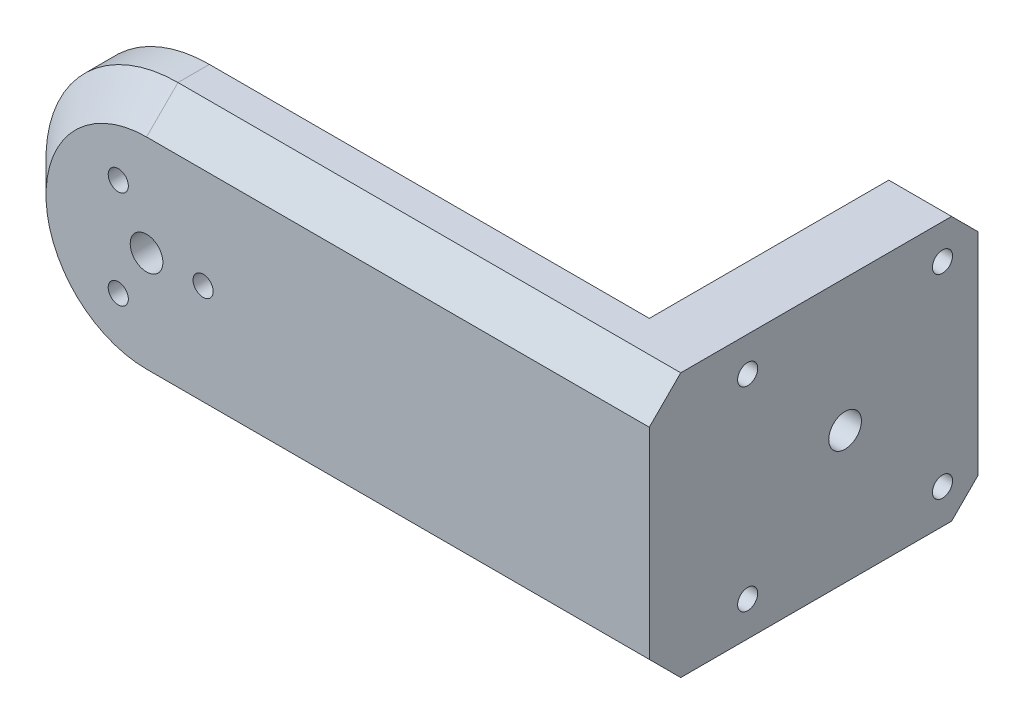
ISO-10303-21;
HEADER;
FILE_DESCRIPTION(('STEP AP214'),'2;1');
FILE_NAME('part.step','',(''),(''),'','','');
FILE_SCHEMA(('AUTOMOTIVE_DESIGN { 1 0 10303 214 1 1 1 1 }'));
ENDSEC;
DATA;
#1=APPLICATION_CONTEXT('core data for automotive mechanical design processes');
#2=APPLICATION_PROTOCOL_DEFINITION('international standard','automotive_design',2000,#1);
#3=PRODUCT_CONTEXT('',#1,'mechanical');
#4=PRODUCT('Part','Part','',(#3));
#5=PRODUCT_RELATED_PRODUCT_CATEGORY('part','',(#4));
#6=PRODUCT_DEFINITION_FORMATION('','',#4);
#7=PRODUCT_DEFINITION_CONTEXT('part definition',#1,'design');
#8=PRODUCT_DEFINITION('design','',#6,#7);
#9=PRODUCT_DEFINITION_SHAPE('','',#8);
#10=(LENGTH_UNIT() NAMED_UNIT(*) SI_UNIT(.MILLI.,.METRE.));
#11=(NAMED_UNIT(*) PLANE_ANGLE_UNIT() SI_UNIT($,.RADIAN.));
#12=(NAMED_UNIT(*) SI_UNIT($,.STERADIAN.) SOLID_ANGLE_UNIT());
#13=UNCERTAINTY_MEASURE_WITH_UNIT(LENGTH_MEASURE(1.E-05),#10,'distance_accuracy_value','');
#14=(GEOMETRIC_REPRESENTATION_CONTEXT(3) GLOBAL_UNCERTAINTY_ASSIGNED_CONTEXT((#13)) GLOBAL_UNIT_ASSIGNED_CONTEXT((#10,
#11,#12)) REPRESENTATION_CONTEXT('',''));
#15=CARTESIAN_POINT('',(0.,0.,0.));
#16=DIRECTION('',(0.,0.,1.));
#17=DIRECTION('',(1.,0.,0.));
#18=AXIS2_PLACEMENT_3D('',#15,#16,#17);
#19=CARTESIAN_POINT('',(80.,0.,-20.15));
#20=DIRECTION('',(-1.,0.,0.));
#21=DIRECTION('',(0.,0.,1.));
#22=AXIS2_PLACEMENT_3D('',#19,#20,#21);
#23=CYLINDRICAL_SURFACE('',#22,2.6);
#24=CARTESIAN_POINT('',(80.,0.,-20.15));
#25=DIRECTION('',(-1.,0.,0.));
#26=DIRECTION('',(0.,0.,1.));
#27=AXIS2_PLACEMENT_3D('',#24,#25,#26);
#28=CIRCLE('',#27,2.6);
#29=CARTESIAN_POINT('',(80.,0.,-17.55));
#30=VERTEX_POINT('',#29);
#31=EDGE_CURVE('E263',#30,#30,#28,.T.);
#32=ORIENTED_EDGE('',*,*,#31,.F.);
#33=EDGE_LOOP('',(#32));
#34=FACE_BOUND('',#33,.T.);
#35=CARTESIAN_POINT('',(73.,0.,-20.15));
#36=DIRECTION('',(-1.,0.,0.));
#37=DIRECTION('',(0.,0.,1.));
#38=AXIS2_PLACEMENT_3D('',#35,#36,#37);
#39=CIRCLE('',#38,2.6);
#40=CARTESIAN_POINT('',(73.,0.,-17.55));
#41=VERTEX_POINT('',#40);
#42=EDGE_CURVE('E183',#41,#41,#39,.F.);
#43=ORIENTED_EDGE('',*,*,#42,.F.);
#44=EDGE_LOOP('',(#43));
#45=FACE_BOUND('',#44,.T.);
#46=ADVANCED_FACE('F39',(#34,#45),#23,.F.);
#47=CARTESIAN_POINT('',(0.,0.,11.));
#48=DIRECTION('',(0.,0.,-1.));
#49=DIRECTION('',(-1.,0.,0.));
#50=AXIS2_PLACEMENT_3D('',#47,#48,#49);
#51=CYLINDRICAL_SURFACE('',#50,12.5);
#52=CARTESIAN_POINT('',(0.,0.,0.));
#53=DIRECTION('',(0.,0.,1.));
#54=DIRECTION('',(1.,0.,0.));
#55=AXIS2_PLACEMENT_3D('',#52,#53,#54);
#56=CIRCLE('',#55,12.5);
#57=CARTESIAN_POINT('',(12.5,0.,0.));
#58=VERTEX_POINT('',#57);
#59=EDGE_CURVE('E170',#58,#58,#56,.T.);
#60=ORIENTED_EDGE('',*,*,#59,.T.);
#61=EDGE_LOOP('',(#60));
#62=FACE_BOUND('',#61,.T.);
#63=CARTESIAN_POINT('',(0.,0.,0.999999999999999));
#64=DIRECTION('',(0.,0.,1.));
#65=DIRECTION('',(1.,0.,0.));
#66=AXIS2_PLACEMENT_3D('',#63,#64,#65);
#67=CIRCLE('',#66,12.5);
#68=CARTESIAN_POINT('',(12.5,0.,0.999999999999999));
#69=VERTEX_POINT('',#68);
#70=EDGE_CURVE('E175',#69,#69,#67,.T.);
#71=ORIENTED_EDGE('',*,*,#70,.F.);
#72=EDGE_LOOP('',(#71));
#73=FACE_BOUND('',#72,.T.);
#74=ADVANCED_FACE('F329',(#62,#73),#51,.T.);
#75=CARTESIAN_POINT('',(0.,0.,11.));
#76=DIRECTION('',(0.,0.,1.));
#77=DIRECTION('',(1.,0.,0.));
#78=AXIS2_PLACEMENT_3D('',#75,#76,#77);
#79=PLANE('',#78);
#80=DIRECTION('',(0.,-1.,0.));
#81=VECTOR('',#80,1.);
#82=CARTESIAN_POINT('',(80.,21.,11.));
#83=LINE('',#82,#81);
#84=CARTESIAN_POINT('',(80.,16.,11.));
#85=VERTEX_POINT('',#84);
#86=CARTESIAN_POINT('',(80.,-16.,11.));
#87=VERTEX_POINT('',#86);
#88=EDGE_CURVE('E128',#85,#87,#83,.T.);
#89=ORIENTED_EDGE('',*,*,#88,.F.);
#90=DIRECTION('',(-1.,0.,0.));
#91=VECTOR('',#90,1.);
#92=CARTESIAN_POINT('',(0.,16.,11.));
#93=LINE('',#92,#91);
#94=CARTESIAN_POINT('',(0.,16.,11.));
#95=VERTEX_POINT('',#94);
#96=EDGE_CURVE('E191',#85,#95,#93,.T.);
#97=ORIENTED_EDGE('',*,*,#96,.T.);
#98=CARTESIAN_POINT('',(0.,0.,11.));
#99=DIRECTION('',(0.,0.,1.));
#100=DIRECTION('',(1.,0.,0.));
#101=AXIS2_PLACEMENT_3D('',#98,#99,#100);
#102=CIRCLE('',#101,16.);
#103=CARTESIAN_POINT('',(0.,-16.,11.));
#104=VERTEX_POINT('',#103);
#105=EDGE_CURVE('E178',#95,#104,#102,.T.);
#106=ORIENTED_EDGE('',*,*,#105,.T.);
#107=DIRECTION('',(1.,0.,0.));
#108=VECTOR('',#107,1.);
#109=CARTESIAN_POINT('',(0.,-16.,11.));
#110=LINE('',#109,#108);
#111=EDGE_CURVE('E189',#104,#87,#110,.T.);
#112=ORIENTED_EDGE('',*,*,#111,.T.);
#113=EDGE_LOOP('',(#89,#97,#106,#112));
#114=FACE_BOUND('',#113,.T.);
#115=CARTESIAN_POINT('',(0.,0.,11.));
#116=DIRECTION('',(0.,0.,-1.));
#117=DIRECTION('',(-1.,0.,0.));
#118=AXIS2_PLACEMENT_3D('',#115,#116,#117);
#119=CIRCLE('',#118,2.6);
#120=CARTESIAN_POINT('',(-2.6,0.,11.));
#121=VERTEX_POINT('',#120);
#122=EDGE_CURVE('E182',#121,#121,#119,.T.);
#123=ORIENTED_EDGE('',*,*,#122,.T.);
#124=EDGE_LOOP('',(#123));
#125=FACE_BOUND('',#124,.T.);
#126=CARTESIAN_POINT('',(-4.50000000000004,-7.79422863405992,11.));
#127=DIRECTION('',(0.,0.,1.));
#128=DIRECTION('',(1.,0.,0.));
#129=AXIS2_PLACEMENT_3D('',#126,#127,#128);
#130=CIRCLE('',#129,1.6);
#131=CARTESIAN_POINT('',(-2.90000000000004,-7.79422863405992,11.));
#132=VERTEX_POINT('',#131);
#133=EDGE_CURVE('E161',#132,#132,#130,.T.);
#134=ORIENTED_EDGE('',*,*,#133,.F.);
#135=EDGE_LOOP('',(#134));
#136=FACE_BOUND('',#135,.T.);
#137=CARTESIAN_POINT('',(9.,0.,11.));
#138=DIRECTION('',(0.,0.,1.));
#139=DIRECTION('',(1.,0.,0.));
#140=AXIS2_PLACEMENT_3D('',#137,#138,#139);
#141=CIRCLE('',#140,1.6);
#142=CARTESIAN_POINT('',(10.6,0.,11.));
#143=VERTEX_POINT('',#142);
#144=EDGE_CURVE('E167',#143,#143,#141,.T.);
#145=ORIENTED_EDGE('',*,*,#144,.F.);
#146=EDGE_LOOP('',(#145));
#147=FACE_BOUND('',#146,.T.);
#148=CARTESIAN_POINT('',(-4.49999999999992,7.79422863405999,11.));
#149=DIRECTION('',(0.,0.,1.));
#150=DIRECTION('',(1.,0.,0.));
#151=AXIS2_PLACEMENT_3D('',#148,#149,#150);
#152=CIRCLE('',#151,1.6);
#153=CARTESIAN_POINT('',(-2.89999999999992,7.79422863405999,11.));
#154=VERTEX_POINT('',#153);
#155=EDGE_CURVE('E155',#154,#154,#152,.T.);
#156=ORIENTED_EDGE('',*,*,#155,.F.);
#157=EDGE_LOOP('',(#156));
#158=FACE_BOUND('',#157,.T.);
#159=ADVANCED_FACE('F250',(#114,#125,#136,#147,#158),#79,.T.);
#160=CARTESIAN_POINT('',(0.,0.,0.));
#161=DIRECTION('',(0.,0.,1.));
#162=DIRECTION('',(1.,0.,0.));
#163=AXIS2_PLACEMENT_3D('',#160,#161,#162);
#164=PLANE('',#163);
#165=CARTESIAN_POINT('',(0.,0.,0.));
#166=DIRECTION('',(0.,0.,1.));
#167=DIRECTION('',(1.,0.,0.));
#168=AXIS2_PLACEMENT_3D('',#165,#166,#167);
#169=CIRCLE('',#168,2.6);
#170=CARTESIAN_POINT('',(2.6,0.,0.));
#171=VERTEX_POINT('',#170);
#172=EDGE_CURVE('E179',#171,#171,#169,.T.);
#173=ORIENTED_EDGE('',*,*,#172,.T.);
#174=EDGE_LOOP('',(#173));
#175=FACE_BOUND('',#174,.T.);
#176=ORIENTED_EDGE('',*,*,#59,.F.);
#177=EDGE_LOOP('',(#176));
#178=FACE_BOUND('',#177,.T.);
#179=CARTESIAN_POINT('',(9.,0.,0.));
#180=DIRECTION('',(0.,0.,1.));
#181=DIRECTION('',(1.,0.,0.));
#182=AXIS2_PLACEMENT_3D('',#179,#180,#181);
#183=CIRCLE('',#182,1.6);
#184=CARTESIAN_POINT('',(10.6,0.,0.));
#185=VERTEX_POINT('',#184);
#186=EDGE_CURVE('E164',#185,#185,#183,.T.);
#187=ORIENTED_EDGE('',*,*,#186,.T.);
#188=EDGE_LOOP('',(#187));
#189=FACE_BOUND('',#188,.T.);
#190=CARTESIAN_POINT('',(-4.50000000000004,-7.79422863405992,0.));
#191=DIRECTION('',(0.,0.,1.));
#192=DIRECTION('',(1.,0.,0.));
#193=AXIS2_PLACEMENT_3D('',#190,#191,#192);
#194=CIRCLE('',#193,1.6);
#195=CARTESIAN_POINT('',(-2.90000000000004,-7.79422863405992,0.));
#196=VERTEX_POINT('',#195);
#197=EDGE_CURVE('E158',#196,#196,#194,.T.);
#198=ORIENTED_EDGE('',*,*,#197,.T.);
#199=EDGE_LOOP('',(#198));
#200=FACE_BOUND('',#199,.T.);
#201=CARTESIAN_POINT('',(-4.49999999999992,7.79422863405999,0.));
#202=DIRECTION('',(0.,0.,1.));
#203=DIRECTION('',(1.,0.,0.));
#204=AXIS2_PLACEMENT_3D('',#201,#202,#203);
#205=CIRCLE('',#204,1.6);
#206=CARTESIAN_POINT('',(-2.89999999999992,7.79422863405999,0.));
#207=VERTEX_POINT('',#206);
#208=EDGE_CURVE('E152',#207,#207,#205,.T.);
#209=ORIENTED_EDGE('',*,*,#208,.T.);
#210=EDGE_LOOP('',(#209));
#211=FACE_BOUND('',#210,.T.);
#212=ADVANCED_FACE('F391',(#175,#178,#189,#200,#211),#164,.F.);
#213=CARTESIAN_POINT('',(9.,0.,11.));
#214=DIRECTION('',(0.,0.,-1.));
#215=DIRECTION('',(-1.,0.,0.));
#216=AXIS2_PLACEMENT_3D('',#213,#214,#215);
#217=CYLINDRICAL_SURFACE('',#216,1.6);
#218=ORIENTED_EDGE('',*,*,#144,.T.);
#219=EDGE_LOOP('',(#218));
#220=FACE_BOUND('',#219,.T.);
#221=ORIENTED_EDGE('',*,*,#186,.F.);
#222=EDGE_LOOP('',(#221));
#223=FACE_BOUND('',#222,.T.);
#224=ADVANCED_FACE('F387',(#220,#223),#217,.F.);
#225=CARTESIAN_POINT('',(-4.50000000000004,-7.79422863405992,11.));
#226=DIRECTION('',(0.,0.,-1.));
#227=DIRECTION('',(-1.,0.,0.));
#228=AXIS2_PLACEMENT_3D('',#225,#226,#227);
#229=CYLINDRICAL_SURFACE('',#228,1.6);
#230=ORIENTED_EDGE('',*,*,#133,.T.);
#231=EDGE_LOOP('',(#230));
#232=FACE_BOUND('',#231,.T.);
#233=ORIENTED_EDGE('',*,*,#197,.F.);
#234=EDGE_LOOP('',(#233));
#235=FACE_BOUND('',#234,.T.);
#236=ADVANCED_FACE('F383',(#232,#235),#229,.F.);
#237=CARTESIAN_POINT('',(-4.49999999999992,7.79422863405999,11.));
#238=DIRECTION('',(0.,0.,-1.));
#239=DIRECTION('',(-1.,0.,0.));
#240=AXIS2_PLACEMENT_3D('',#237,#238,#239);
#241=CYLINDRICAL_SURFACE('',#240,1.6);
#242=ORIENTED_EDGE('',*,*,#155,.T.);
#243=EDGE_LOOP('',(#242));
#244=FACE_BOUND('',#243,.T.);
#245=ORIENTED_EDGE('',*,*,#208,.F.);
#246=EDGE_LOOP('',(#245));
#247=FACE_BOUND('',#246,.T.);
#248=ADVANCED_FACE('F380',(#244,#247),#241,.F.);
#249=CARTESIAN_POINT('',(0.,0.,0.999999999999999));
#250=DIRECTION('',(0.,0.,1.));
#251=DIRECTION('',(1.,0.,0.));
#252=AXIS2_PLACEMENT_3D('',#249,#250,#251);
#253=CYLINDRICAL_SURFACE('',#252,21.);
#254=DIRECTION('',(0.,0.,1.));
#255=VECTOR('',#254,1.);
#256=CARTESIAN_POINT('',(0.,-21.,0.999999999999999));
#257=LINE('',#256,#255);
#258=CARTESIAN_POINT('',(0.,-21.,0.999999999999999));
#259=VERTEX_POINT('',#258);
#260=CARTESIAN_POINT('',(0.,-21.,6.00000000000002));
#261=VERTEX_POINT('',#260);
#262=EDGE_CURVE('E139',#259,#261,#257,.T.);
#263=ORIENTED_EDGE('',*,*,#262,.T.);
#264=CARTESIAN_POINT('',(0.,0.,6.00000000000002));
#265=DIRECTION('',(0.,0.,1.));
#266=DIRECTION('',(1.,0.,0.));
#267=AXIS2_PLACEMENT_3D('',#264,#265,#266);
#268=CIRCLE('',#267,21.);
#269=CARTESIAN_POINT('',(0.,21.,6.00000000000002));
#270=VERTEX_POINT('',#269);
#271=EDGE_CURVE('E203',#261,#270,#268,.F.);
#272=ORIENTED_EDGE('',*,*,#271,.T.);
#273=DIRECTION('',(0.,0.,1.));
#274=VECTOR('',#273,1.);
#275=CARTESIAN_POINT('',(0.,21.,0.999999999999999));
#276=LINE('',#275,#274);
#277=CARTESIAN_POINT('',(0.,21.,0.999999999999999));
#278=VERTEX_POINT('',#277);
#279=EDGE_CURVE('E150',#278,#270,#276,.T.);
#280=ORIENTED_EDGE('',*,*,#279,.F.);
#281=CARTESIAN_POINT('',(0.,0.,0.999999999999999));
#282=DIRECTION('',(0.,0.,1.));
#283=DIRECTION('',(1.,0.,0.));
#284=AXIS2_PLACEMENT_3D('',#281,#282,#283);
#285=CIRCLE('',#284,21.);
#286=EDGE_CURVE('E138',#278,#259,#285,.T.);
#287=ORIENTED_EDGE('',*,*,#286,.T.);
#288=EDGE_LOOP('',(#263,#272,#280,#287));
#289=FACE_BOUND('',#288,.T.);
#290=ADVANCED_FACE('F375',(#289),#253,.T.);
#291=CARTESIAN_POINT('',(0.,21.,0.999999999999999));
#292=DIRECTION('',(0.,1.,0.));
#293=DIRECTION('',(-1.,0.,0.));
#294=AXIS2_PLACEMENT_3D('',#291,#292,#293);
#295=PLANE('',#294);
#296=DIRECTION('',(0.,0.,1.));
#297=VECTOR('',#296,1.);
#298=CARTESIAN_POINT('',(80.,21.,11.));
#299=LINE('',#298,#297);
#300=CARTESIAN_POINT('',(80.,21.,-37.1));
#301=VERTEX_POINT('',#300);
#302=CARTESIAN_POINT('',(80.,21.,6.00000000000002));
#303=VERTEX_POINT('',#302);
#304=EDGE_CURVE('E232',#301,#303,#299,.T.);
#305=ORIENTED_EDGE('',*,*,#304,.F.);
#306=DIRECTION('',(-1.,0.,0.));
#307=VECTOR('',#306,1.);
#308=CARTESIAN_POINT('',(70.,21.,-37.1));
#309=LINE('',#308,#307);
#310=CARTESIAN_POINT('',(70.,21.,-37.1));
#311=VERTEX_POINT('',#310);
#312=EDGE_CURVE('E11',#301,#311,#309,.T.);
#313=ORIENTED_EDGE('',*,*,#312,.T.);
#314=DIRECTION('',(0.,0.,1.));
#315=VECTOR('',#314,1.);
#316=CARTESIAN_POINT('',(70.,21.,11.));
#317=LINE('',#316,#315);
#318=CARTESIAN_POINT('',(70.,21.,0.999999999999999));
#319=VERTEX_POINT('',#318);
#320=EDGE_CURVE('E120',#311,#319,#317,.T.);
#321=ORIENTED_EDGE('',*,*,#320,.T.);
#322=DIRECTION('',(-1.,0.,0.));
#323=VECTOR('',#322,1.);
#324=CARTESIAN_POINT('',(0.,21.,0.999999999999999));
#325=LINE('',#324,#323);
#326=EDGE_CURVE('E124',#319,#278,#325,.T.);
#327=ORIENTED_EDGE('',*,*,#326,.T.);
#328=ORIENTED_EDGE('',*,*,#279,.T.);
#329=DIRECTION('',(1.,0.,0.));
#330=VECTOR('',#329,1.);
#331=CARTESIAN_POINT('',(0.,21.,6.00000000000002));
#332=LINE('',#331,#330);
#333=EDGE_CURVE('E194',#270,#303,#332,.T.);
#334=ORIENTED_EDGE('',*,*,#333,.T.);
#335=EDGE_LOOP('',(#305,#313,#321,#327,#328,#334));
#336=FACE_BOUND('',#335,.T.);
#337=ADVANCED_FACE('F122',(#336),#295,.T.);
#338=CARTESIAN_POINT('',(70.,-21.,0.999999999999999));
#339=DIRECTION('',(0.,-1.,0.));
#340=DIRECTION('',(1.,0.,0.));
#341=AXIS2_PLACEMENT_3D('',#338,#339,#340);
#342=PLANE('',#341);
#343=DIRECTION('',(0.,0.,-1.));
#344=VECTOR('',#343,1.);
#345=CARTESIAN_POINT('',(70.,-21.,11.));
#346=LINE('',#345,#344);
#347=CARTESIAN_POINT('',(70.,-21.,0.999999999999999));
#348=VERTEX_POINT('',#347);
#349=CARTESIAN_POINT('',(70.,-21.,-37.1));
#350=VERTEX_POINT('',#349);
#351=EDGE_CURVE('E144',#348,#350,#346,.T.);
#352=ORIENTED_EDGE('',*,*,#351,.T.);
#353=DIRECTION('',(1.,0.,0.));
#354=VECTOR('',#353,1.);
#355=CARTESIAN_POINT('',(80.,-21.,-37.1));
#356=LINE('',#355,#354);
#357=CARTESIAN_POINT('',(80.,-21.,-37.1));
#358=VERTEX_POINT('',#357);
#359=EDGE_CURVE('E63',#350,#358,#356,.T.);
#360=ORIENTED_EDGE('',*,*,#359,.T.);
#361=DIRECTION('',(0.,0.,-1.));
#362=VECTOR('',#361,1.);
#363=CARTESIAN_POINT('',(80.,-21.,11.));
#364=LINE('',#363,#362);
#365=CARTESIAN_POINT('',(80.,-21.,6.00000000000002));
#366=VERTEX_POINT('',#365);
#367=EDGE_CURVE('E225',#366,#358,#364,.T.);
#368=ORIENTED_EDGE('',*,*,#367,.F.);
#369=DIRECTION('',(-1.,0.,0.));
#370=VECTOR('',#369,1.);
#371=CARTESIAN_POINT('',(70.,-21.,6.00000000000002));
#372=LINE('',#371,#370);
#373=EDGE_CURVE('E201',#366,#261,#372,.T.);
#374=ORIENTED_EDGE('',*,*,#373,.T.);
#375=ORIENTED_EDGE('',*,*,#262,.F.);
#376=DIRECTION('',(1.,0.,0.));
#377=VECTOR('',#376,1.);
#378=CARTESIAN_POINT('',(70.,-21.,0.999999999999999));
#379=LINE('',#378,#377);
#380=EDGE_CURVE('E145',#259,#348,#379,.T.);
#381=ORIENTED_EDGE('',*,*,#380,.T.);
#382=EDGE_LOOP('',(#352,#360,#368,#374,#375,#381));
#383=FACE_BOUND('',#382,.T.);
#384=ADVANCED_FACE('F235',(#383),#342,.T.);
#385=CARTESIAN_POINT('',(0.,0.,0.999999999999999));
#386=DIRECTION('',(0.,0.,1.));
#387=DIRECTION('',(1.,0.,0.));
#388=AXIS2_PLACEMENT_3D('',#385,#386,#387);
#389=PLANE('',#388);
#390=ORIENTED_EDGE('',*,*,#70,.T.);
#391=EDGE_LOOP('',(#390));
#392=FACE_BOUND('',#391,.T.);
#393=ORIENTED_EDGE('',*,*,#286,.F.);
#394=ORIENTED_EDGE('',*,*,#326,.F.);
#395=DIRECTION('',(0.,1.,0.));
#396=VECTOR('',#395,1.);
#397=CARTESIAN_POINT('',(70.,21.,0.999999999999999));
#398=LINE('',#397,#396);
#399=EDGE_CURVE('E135',#348,#319,#398,.T.);
#400=ORIENTED_EDGE('',*,*,#399,.F.);
#401=ORIENTED_EDGE('',*,*,#380,.F.);
#402=EDGE_LOOP('',(#393,#394,#400,#401));
#403=FACE_BOUND('',#402,.T.);
#404=ADVANCED_FACE('F133',(#392,#403),#389,.F.);
#405=CARTESIAN_POINT('',(70.,0.,0.));
#406=DIRECTION('',(1.,0.,0.));
#407=DIRECTION('',(0.,0.,-1.));
#408=AXIS2_PLACEMENT_3D('',#405,#406,#407);
#409=PLANE('',#408);
#410=CARTESIAN_POINT('',(70.,0.,-20.15));
#411=DIRECTION('',(-1.,0.,0.));
#412=DIRECTION('',(0.,0.,1.));
#413=AXIS2_PLACEMENT_3D('',#410,#411,#412);
#414=CIRCLE('',#413,11.5);
#415=CARTESIAN_POINT('',(70.,0.,-8.65000000000001));
#416=VERTEX_POINT('',#415);
#417=EDGE_CURVE('E211',#416,#416,#414,.T.);
#418=ORIENTED_EDGE('',*,*,#417,.F.);
#419=EDGE_LOOP('',(#418));
#420=FACE_BOUND('',#419,.T.);
#421=CARTESIAN_POINT('',(70.,-15.5,-35.6499999999997));
#422=DIRECTION('',(-1.,0.,0.));
#423=DIRECTION('',(0.,0.,1.));
#424=AXIS2_PLACEMENT_3D('',#421,#422,#423);
#425=CIRCLE('',#424,1.6);
#426=CARTESIAN_POINT('',(70.,-15.5,-34.0499999999997));
#427=VERTEX_POINT('',#426);
#428=EDGE_CURVE('E186',#427,#427,#425,.T.);
#429=ORIENTED_EDGE('',*,*,#428,.F.);
#430=EDGE_LOOP('',(#429));
#431=FACE_BOUND('',#430,.T.);
#432=CARTESIAN_POINT('',(70.,-15.5,-4.64999999999968));
#433=DIRECTION('',(-1.,0.,0.));
#434=DIRECTION('',(0.,0.,1.));
#435=AXIS2_PLACEMENT_3D('',#432,#433,#434);
#436=CIRCLE('',#435,1.6);
#437=CARTESIAN_POINT('',(70.,-15.5,-3.04999999999968));
#438=VERTEX_POINT('',#437);
#439=EDGE_CURVE('E271',#438,#438,#436,.T.);
#440=ORIENTED_EDGE('',*,*,#439,.F.);
#441=EDGE_LOOP('',(#440));
#442=FACE_BOUND('',#441,.T.);
#443=CARTESIAN_POINT('',(70.,15.5,-4.65000000000001));
#444=DIRECTION('',(-1.,0.,0.));
#445=DIRECTION('',(0.,0.,1.));
#446=AXIS2_PLACEMENT_3D('',#443,#444,#445);
#447=CIRCLE('',#446,1.6);
#448=CARTESIAN_POINT('',(70.,15.5,-3.05000000000001));
#449=VERTEX_POINT('',#448);
#450=EDGE_CURVE('E277',#449,#449,#447,.T.);
#451=ORIENTED_EDGE('',*,*,#450,.F.);
#452=EDGE_LOOP('',(#451));
#453=FACE_BOUND('',#452,.T.);
#454=CARTESIAN_POINT('',(70.,15.5,-35.65));
#455=DIRECTION('',(-1.,0.,0.));
#456=DIRECTION('',(0.,0.,1.));
#457=AXIS2_PLACEMENT_3D('',#454,#455,#456);
#458=CIRCLE('',#457,1.6);
#459=CARTESIAN_POINT('',(70.,15.5,-34.05));
#460=VERTEX_POINT('',#459);
#461=EDGE_CURVE('E260',#460,#460,#458,.T.);
#462=ORIENTED_EDGE('',*,*,#461,.F.);
#463=EDGE_LOOP('',(#462));
#464=FACE_BOUND('',#463,.T.);
#465=DIRECTION('',(0.,1.,0.));
#466=VECTOR('',#465,1.);
#467=CARTESIAN_POINT('',(70.,21.,-41.3));
#468=LINE('',#467,#466);
#469=CARTESIAN_POINT('',(70.,-16.8,-41.3));
#470=VERTEX_POINT('',#469);
#471=CARTESIAN_POINT('',(70.,16.8,-41.3));
#472=VERTEX_POINT('',#471);
#473=EDGE_CURVE('E129',#470,#472,#468,.T.);
#474=ORIENTED_EDGE('',*,*,#473,.F.);
#475=DIRECTION('',(0.,-0.707106781186547,0.707106781186548));
#476=VECTOR('',#475,1.);
#477=CARTESIAN_POINT('',(70.,-16.8,-41.3));
#478=LINE('',#477,#476);
#479=EDGE_CURVE('E218',#470,#350,#478,.T.);
#480=ORIENTED_EDGE('',*,*,#479,.T.);
#481=ORIENTED_EDGE('',*,*,#351,.F.);
#482=ORIENTED_EDGE('',*,*,#399,.T.);
#483=ORIENTED_EDGE('',*,*,#320,.F.);
#484=DIRECTION('',(0.,-0.707106781186549,-0.707106781186546));
#485=VECTOR('',#484,1.);
#486=CARTESIAN_POINT('',(70.,21.,-37.1));
#487=LINE('',#486,#485);
#488=EDGE_CURVE('E216',#311,#472,#487,.T.);
#489=ORIENTED_EDGE('',*,*,#488,.T.);
#490=EDGE_LOOP('',(#474,#480,#481,#482,#483,#489));
#491=FACE_BOUND('',#490,.T.);
#492=ADVANCED_FACE('F143',(#420,#431,#442,#453,#464,#491),#409,.F.);
#493=CARTESIAN_POINT('',(80.,21.,-41.3));
#494=DIRECTION('',(0.,0.,1.));
#495=DIRECTION('',(1.,0.,0.));
#496=AXIS2_PLACEMENT_3D('',#493,#494,#495);
#497=PLANE('',#496);
#498=DIRECTION('',(0.,1.,0.));
#499=VECTOR('',#498,1.);
#500=CARTESIAN_POINT('',(80.,21.,-41.3));
#501=LINE('',#500,#499);
#502=CARTESIAN_POINT('',(80.,-16.8,-41.3));
#503=VERTEX_POINT('',#502);
#504=CARTESIAN_POINT('',(80.,16.8,-41.3));
#505=VERTEX_POINT('',#504);
#506=EDGE_CURVE('E224',#503,#505,#501,.T.);
#507=ORIENTED_EDGE('',*,*,#506,.F.);
#508=DIRECTION('',(-1.,0.,0.));
#509=VECTOR('',#508,1.);
#510=CARTESIAN_POINT('',(70.,-16.8,-41.3));
#511=LINE('',#510,#509);
#512=EDGE_CURVE('E213',#503,#470,#511,.T.);
#513=ORIENTED_EDGE('',*,*,#512,.T.);
#514=ORIENTED_EDGE('',*,*,#473,.T.);
#515=DIRECTION('',(1.,0.,0.));
#516=VECTOR('',#515,1.);
#517=CARTESIAN_POINT('',(80.,16.8,-41.3));
#518=LINE('',#517,#516);
#519=EDGE_CURVE('E205',#472,#505,#518,.T.);
#520=ORIENTED_EDGE('',*,*,#519,.T.);
#521=EDGE_LOOP('',(#507,#513,#514,#520));
#522=FACE_BOUND('',#521,.T.);
#523=ADVANCED_FACE('F229',(#522),#497,.F.);
#524=CARTESIAN_POINT('',(80.,0.,0.));
#525=DIRECTION('',(1.,0.,0.));
#526=DIRECTION('',(0.,0.,-1.));
#527=AXIS2_PLACEMENT_3D('',#524,#525,#526);
#528=PLANE('',#527);
#529=CARTESIAN_POINT('',(80.,-15.5,-35.6499999999997));
#530=DIRECTION('',(-1.,0.,0.));
#531=DIRECTION('',(0.,0.,1.));
#532=AXIS2_PLACEMENT_3D('',#529,#530,#531);
#533=CIRCLE('',#532,1.6);
#534=CARTESIAN_POINT('',(80.,-15.5,-34.0499999999997));
#535=VERTEX_POINT('',#534);
#536=EDGE_CURVE('E268',#535,#535,#533,.T.);
#537=ORIENTED_EDGE('',*,*,#536,.T.);
#538=EDGE_LOOP('',(#537));
#539=FACE_BOUND('',#538,.T.);
#540=CARTESIAN_POINT('',(80.,-15.5,-4.64999999999968));
#541=DIRECTION('',(-1.,0.,0.));
#542=DIRECTION('',(0.,0.,1.));
#543=AXIS2_PLACEMENT_3D('',#540,#541,#542);
#544=CIRCLE('',#543,1.6);
#545=CARTESIAN_POINT('',(80.,-15.5,-3.04999999999968));
#546=VERTEX_POINT('',#545);
#547=EDGE_CURVE('E274',#546,#546,#544,.T.);
#548=ORIENTED_EDGE('',*,*,#547,.T.);
#549=EDGE_LOOP('',(#548));
#550=FACE_BOUND('',#549,.T.);
#551=CARTESIAN_POINT('',(80.,15.5,-4.65000000000001));
#552=DIRECTION('',(-1.,0.,0.));
#553=DIRECTION('',(0.,0.,1.));
#554=AXIS2_PLACEMENT_3D('',#551,#552,#553);
#555=CIRCLE('',#554,1.6);
#556=CARTESIAN_POINT('',(80.,15.5,-3.05000000000001));
#557=VERTEX_POINT('',#556);
#558=EDGE_CURVE('E280',#557,#557,#555,.T.);
#559=ORIENTED_EDGE('',*,*,#558,.T.);
#560=EDGE_LOOP('',(#559));
#561=FACE_BOUND('',#560,.T.);
#562=ORIENTED_EDGE('',*,*,#31,.T.);
#563=EDGE_LOOP('',(#562));
#564=FACE_BOUND('',#563,.T.);
#565=CARTESIAN_POINT('',(80.,15.5,-35.65));
#566=DIRECTION('',(-1.,0.,0.));
#567=DIRECTION('',(0.,0.,1.));
#568=AXIS2_PLACEMENT_3D('',#565,#566,#567);
#569=CIRCLE('',#568,1.6);
#570=CARTESIAN_POINT('',(80.,15.5,-34.05));
#571=VERTEX_POINT('',#570);
#572=EDGE_CURVE('E259',#571,#571,#569,.T.);
#573=ORIENTED_EDGE('',*,*,#572,.T.);
#574=EDGE_LOOP('',(#573));
#575=FACE_BOUND('',#574,.T.);
#576=ORIENTED_EDGE('',*,*,#367,.T.);
#577=DIRECTION('',(0.,0.707106781186547,-0.707106781186548));
#578=VECTOR('',#577,1.);
#579=CARTESIAN_POINT('',(80.,-29.05,-29.05));
#580=LINE('',#579,#578);
#581=EDGE_CURVE('E48',#358,#503,#580,.T.);
#582=ORIENTED_EDGE('',*,*,#581,.T.);
#583=ORIENTED_EDGE('',*,*,#506,.T.);
#584=DIRECTION('',(0.,0.707106781186549,0.707106781186546));
#585=VECTOR('',#584,1.);
#586=CARTESIAN_POINT('',(80.,29.05,-29.0500000000001));
#587=LINE('',#586,#585);
#588=EDGE_CURVE('E55',#505,#301,#587,.T.);
#589=ORIENTED_EDGE('',*,*,#588,.T.);
#590=ORIENTED_EDGE('',*,*,#304,.T.);
#591=DIRECTION('',(0.,0.707106781186547,-0.707106781186548));
#592=VECTOR('',#591,1.);
#593=CARTESIAN_POINT('',(80.,13.5,13.5));
#594=LINE('',#593,#592);
#595=EDGE_CURVE('E199',#303,#85,#594,.F.);
#596=ORIENTED_EDGE('',*,*,#595,.T.);
#597=ORIENTED_EDGE('',*,*,#88,.T.);
#598=DIRECTION('',(0.,0.707106781186547,0.707106781186548));
#599=VECTOR('',#598,1.);
#600=CARTESIAN_POINT('',(80.,-13.5,13.5));
#601=LINE('',#600,#599);
#602=EDGE_CURVE('E197',#87,#366,#601,.F.);
#603=ORIENTED_EDGE('',*,*,#602,.T.);
#604=EDGE_LOOP('',(#576,#582,#583,#589,#590,#596,#597,#603));
#605=FACE_BOUND('',#604,.T.);
#606=ADVANCED_FACE('F223',(#539,#550,#561,#564,#575,#605),#528,.T.);
#607=CARTESIAN_POINT('',(0.,0.,11.));
#608=DIRECTION('',(0.,0.,-1.));
#609=DIRECTION('',(-1.,0.,0.));
#610=AXIS2_PLACEMENT_3D('',#607,#608,#609);
#611=CYLINDRICAL_SURFACE('',#610,2.6);
#612=ORIENTED_EDGE('',*,*,#122,.F.);
#613=EDGE_LOOP('',(#612));
#614=FACE_BOUND('',#613,.T.);
#615=ORIENTED_EDGE('',*,*,#172,.F.);
#616=EDGE_LOOP('',(#615));
#617=FACE_BOUND('',#616,.T.);
#618=ADVANCED_FACE('F314',(#614,#617),#611,.F.);
#619=CARTESIAN_POINT('',(80.,15.5,-35.65));
#620=DIRECTION('',(-1.,0.,0.));
#621=DIRECTION('',(0.,0.,1.));
#622=AXIS2_PLACEMENT_3D('',#619,#620,#621);
#623=CYLINDRICAL_SURFACE('',#622,1.6);
#624=ORIENTED_EDGE('',*,*,#572,.F.);
#625=EDGE_LOOP('',(#624));
#626=FACE_BOUND('',#625,.T.);
#627=ORIENTED_EDGE('',*,*,#461,.T.);
#628=EDGE_LOOP('',(#627));
#629=FACE_BOUND('',#628,.T.);
#630=ADVANCED_FACE('F311',(#626,#629),#623,.F.);
#631=CARTESIAN_POINT('',(80.,15.5,-4.65000000000001));
#632=DIRECTION('',(-1.,0.,0.));
#633=DIRECTION('',(0.,0.,1.));
#634=AXIS2_PLACEMENT_3D('',#631,#632,#633);
#635=CYLINDRICAL_SURFACE('',#634,1.6);
#636=ORIENTED_EDGE('',*,*,#558,.F.);
#637=EDGE_LOOP('',(#636));
#638=FACE_BOUND('',#637,.T.);
#639=ORIENTED_EDGE('',*,*,#450,.T.);
#640=EDGE_LOOP('',(#639));
#641=FACE_BOUND('',#640,.T.);
#642=ADVANCED_FACE('F313',(#638,#641),#635,.F.);
#643=CARTESIAN_POINT('',(80.,-15.5,-4.64999999999968));
#644=DIRECTION('',(-1.,0.,0.));
#645=DIRECTION('',(0.,0.,1.));
#646=AXIS2_PLACEMENT_3D('',#643,#644,#645);
#647=CYLINDRICAL_SURFACE('',#646,1.6);
#648=ORIENTED_EDGE('',*,*,#547,.F.);
#649=EDGE_LOOP('',(#648));
#650=FACE_BOUND('',#649,.T.);
#651=ORIENTED_EDGE('',*,*,#439,.T.);
#652=EDGE_LOOP('',(#651));
#653=FACE_BOUND('',#652,.T.);
#654=ADVANCED_FACE('F321',(#650,#653),#647,.F.);
#655=CARTESIAN_POINT('',(80.,-15.5,-35.6499999999997));
#656=DIRECTION('',(-1.,0.,0.));
#657=DIRECTION('',(0.,0.,1.));
#658=AXIS2_PLACEMENT_3D('',#655,#656,#657);
#659=CYLINDRICAL_SURFACE('',#658,1.6);
#660=ORIENTED_EDGE('',*,*,#536,.F.);
#661=EDGE_LOOP('',(#660));
#662=FACE_BOUND('',#661,.T.);
#663=ORIENTED_EDGE('',*,*,#428,.T.);
#664=EDGE_LOOP('',(#663));
#665=FACE_BOUND('',#664,.T.);
#666=ADVANCED_FACE('F344',(#662,#665),#659,.F.);
#667=CARTESIAN_POINT('',(73.,0.,-20.15));
#668=DIRECTION('',(-1.,0.,0.));
#669=DIRECTION('',(0.,0.,1.));
#670=AXIS2_PLACEMENT_3D('',#667,#668,#669);
#671=PLANE('',#670);
#672=CARTESIAN_POINT('',(73.,0.,-20.15));
#673=DIRECTION('',(-1.,0.,0.));
#674=DIRECTION('',(0.,0.,1.));
#675=AXIS2_PLACEMENT_3D('',#672,#673,#674);
#676=CIRCLE('',#675,11.5);
#677=CARTESIAN_POINT('',(73.,0.,-8.65000000000001));
#678=VERTEX_POINT('',#677);
#679=EDGE_CURVE('E187',#678,#678,#676,.T.);
#680=ORIENTED_EDGE('',*,*,#679,.T.);
#681=EDGE_LOOP('',(#680));
#682=FACE_BOUND('',#681,.T.);
#683=ORIENTED_EDGE('',*,*,#42,.T.);
#684=EDGE_LOOP('',(#683));
#685=FACE_BOUND('',#684,.T.);
#686=ADVANCED_FACE('F290',(#682,#685),#671,.T.);
#687=CARTESIAN_POINT('',(73.,0.,-20.15));
#688=DIRECTION('',(-1.,0.,0.));
#689=DIRECTION('',(0.,0.,1.));
#690=AXIS2_PLACEMENT_3D('',#687,#688,#689);
#691=CYLINDRICAL_SURFACE('',#690,11.5);
#692=ORIENTED_EDGE('',*,*,#679,.F.);
#693=EDGE_LOOP('',(#692));
#694=FACE_BOUND('',#693,.T.);
#695=ORIENTED_EDGE('',*,*,#417,.T.);
#696=EDGE_LOOP('',(#695));
#697=FACE_BOUND('',#696,.T.);
#698=ADVANCED_FACE('F293',(#694,#697),#691,.F.);
#699=CARTESIAN_POINT('',(0.,-16.,11.));
#700=DIRECTION('',(0.,0.707106781186548,-0.707106781186547));
#701=DIRECTION('',(1.,0.,0.));
#702=AXIS2_PLACEMENT_3D('',#699,#700,#701);
#703=PLANE('',#702);
#704=ORIENTED_EDGE('',*,*,#602,.F.);
#705=ORIENTED_EDGE('',*,*,#111,.F.);
#706=DIRECTION('',(0.,0.707106781186547,0.707106781186548));
#707=VECTOR('',#706,1.);
#708=CARTESIAN_POINT('',(0.,-21.,6.00000000000002));
#709=LINE('',#708,#707);
#710=EDGE_CURVE('E208',#261,#104,#709,.T.);
#711=ORIENTED_EDGE('',*,*,#710,.F.);
#712=ORIENTED_EDGE('',*,*,#373,.F.);
#713=EDGE_LOOP('',(#704,#705,#711,#712));
#714=FACE_BOUND('',#713,.T.);
#715=ADVANCED_FACE('F296',(#714),#703,.F.);
#716=CARTESIAN_POINT('',(0.,0.,11.));
#717=DIRECTION('',(0.,0.,-1.));
#718=DIRECTION('',(-1.,0.,0.));
#719=AXIS2_PLACEMENT_3D('',#716,#717,#718);
#720=CONICAL_SURFACE('',#719,16.,0.785398163397448);
#721=ORIENTED_EDGE('',*,*,#710,.T.);
#722=ORIENTED_EDGE('',*,*,#105,.F.);
#723=DIRECTION('',(0.,-0.707106781186547,0.707106781186548));
#724=VECTOR('',#723,1.);
#725=CARTESIAN_POINT('',(0.,21.,6.00000000000002));
#726=LINE('',#725,#724);
#727=EDGE_CURVE('E206',#270,#95,#726,.T.);
#728=ORIENTED_EDGE('',*,*,#727,.F.);
#729=ORIENTED_EDGE('',*,*,#271,.F.);
#730=EDGE_LOOP('',(#721,#722,#728,#729));
#731=FACE_BOUND('',#730,.T.);
#732=ADVANCED_FACE('F405',(#731),#720,.T.);
#733=CARTESIAN_POINT('',(0.,16.,11.));
#734=DIRECTION('',(0.,-0.707106781186548,-0.707106781186547));
#735=DIRECTION('',(-1.,0.,0.));
#736=AXIS2_PLACEMENT_3D('',#733,#734,#735);
#737=PLANE('',#736);
#738=ORIENTED_EDGE('',*,*,#595,.F.);
#739=ORIENTED_EDGE('',*,*,#333,.F.);
#740=ORIENTED_EDGE('',*,*,#727,.T.);
#741=ORIENTED_EDGE('',*,*,#96,.F.);
#742=EDGE_LOOP('',(#738,#739,#740,#741));
#743=FACE_BOUND('',#742,.T.);
#744=ADVANCED_FACE('F247',(#743),#737,.F.);
#745=CARTESIAN_POINT('',(80.,-16.8,-41.3));
#746=DIRECTION('',(0.,-0.707106781186548,-0.707106781186547));
#747=DIRECTION('',(1.,0.,0.));
#748=AXIS2_PLACEMENT_3D('',#745,#746,#747);
#749=PLANE('',#748);
#750=ORIENTED_EDGE('',*,*,#581,.F.);
#751=ORIENTED_EDGE('',*,*,#359,.F.);
#752=ORIENTED_EDGE('',*,*,#479,.F.);
#753=ORIENTED_EDGE('',*,*,#512,.F.);
#754=EDGE_LOOP('',(#750,#751,#752,#753));
#755=FACE_BOUND('',#754,.T.);
#756=ADVANCED_FACE('F234',(#755),#749,.T.);
#757=CARTESIAN_POINT('',(0.,21.,-37.1));
#758=DIRECTION('',(0.,0.707106781186546,-0.707106781186549));
#759=DIRECTION('',(1.,0.,0.));
#760=AXIS2_PLACEMENT_3D('',#757,#758,#759);
#761=PLANE('',#760);
#762=ORIENTED_EDGE('',*,*,#588,.F.);
#763=ORIENTED_EDGE('',*,*,#519,.F.);
#764=ORIENTED_EDGE('',*,*,#488,.F.);
#765=ORIENTED_EDGE('',*,*,#312,.F.);
#766=EDGE_LOOP('',(#762,#763,#764,#765));
#767=FACE_BOUND('',#766,.T.);
#768=ADVANCED_FACE('F42',(#767),#761,.T.);
#769=CLOSED_SHELL('',(#46,#74,#159,#212,#224,#236,#248,#290,#337,#384,#404,#492,#523,#606,#618,
#630,#642,#654,#666,#686,#698,#715,#732,#744,#756,#768));
#770=MANIFOLD_SOLID_BREP('B2',#769);
#771=ADVANCED_BREP_SHAPE_REPRESENTATION('',(#18,#770),#14);
#772=SHAPE_DEFINITION_REPRESENTATION(#9,#771);
ENDSEC;
END-ISO-10303-21;
